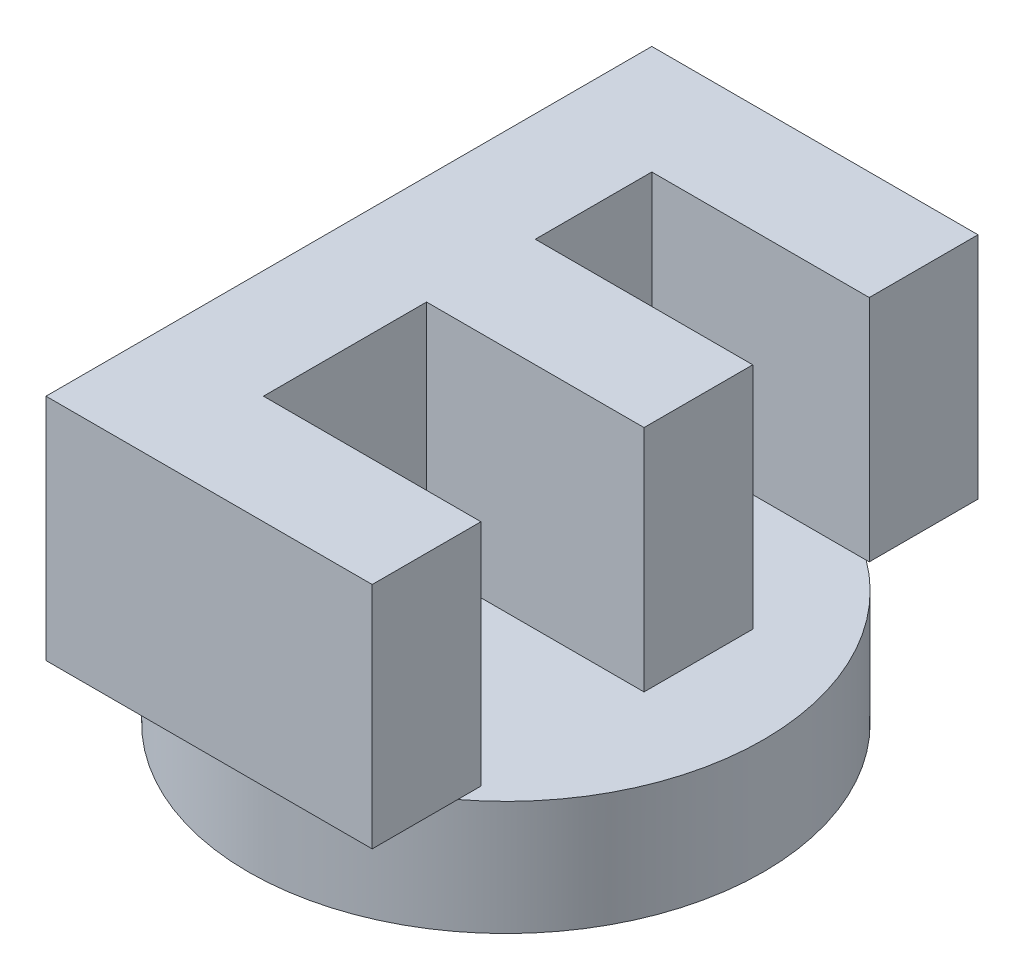
ISO-10303-21;
HEADER;
FILE_DESCRIPTION(('STEP AP214'),'2;1');
FILE_NAME('part.step','',(''),(''),'','','');
FILE_SCHEMA(('AUTOMOTIVE_DESIGN { 1 0 10303 214 1 1 1 1 }'));
ENDSEC;
DATA;
#1=APPLICATION_CONTEXT('core data for automotive mechanical design processes');
#2=APPLICATION_PROTOCOL_DEFINITION('international standard','automotive_design',2000,#1);
#3=PRODUCT_CONTEXT('',#1,'mechanical');
#4=PRODUCT('Part','Part','',(#3));
#5=PRODUCT_RELATED_PRODUCT_CATEGORY('part','',(#4));
#6=PRODUCT_DEFINITION_FORMATION('','',#4);
#7=PRODUCT_DEFINITION_CONTEXT('part definition',#1,'design');
#8=PRODUCT_DEFINITION('design','',#6,#7);
#9=PRODUCT_DEFINITION_SHAPE('','',#8);
#10=(LENGTH_UNIT() NAMED_UNIT(*) SI_UNIT(.MILLI.,.METRE.));
#11=(NAMED_UNIT(*) PLANE_ANGLE_UNIT() SI_UNIT($,.RADIAN.));
#12=(NAMED_UNIT(*) SI_UNIT($,.STERADIAN.) SOLID_ANGLE_UNIT());
#13=UNCERTAINTY_MEASURE_WITH_UNIT(LENGTH_MEASURE(1.E-05),#10,'distance_accuracy_value','');
#14=(GEOMETRIC_REPRESENTATION_CONTEXT(3) GLOBAL_UNCERTAINTY_ASSIGNED_CONTEXT((#13)) GLOBAL_UNIT_ASSIGNED_CONTEXT((#10,
#11,#12)) REPRESENTATION_CONTEXT('',''));
#15=CARTESIAN_POINT('',(0.,0.,0.));
#16=DIRECTION('',(0.,0.,1.));
#17=DIRECTION('',(1.,0.,0.));
#18=AXIS2_PLACEMENT_3D('',#15,#16,#17);
#19=CARTESIAN_POINT('',(0.,10.,0.));
#20=DIRECTION('',(0.,1.,0.));
#21=DIRECTION('',(0.,0.,1.));
#22=AXIS2_PLACEMENT_3D('',#19,#20,#21);
#23=PLANE('',#22);
#24=CARTESIAN_POINT('',(0.,10.,0.));
#25=DIRECTION('',(0.,1.,0.));
#26=DIRECTION('',(0.,0.,1.));
#27=AXIS2_PLACEMENT_3D('',#24,#25,#26);
#28=CIRCLE('',#27,22.5);
#29=CARTESIAN_POINT('',(-14.8289017434471,10.,-16.9219878584991));
#30=VERTEX_POINT('',#29);
#31=CARTESIAN_POINT('',(-14.8289017434471,10.,16.9219878584991));
#32=VERTEX_POINT('',#31);
#33=EDGE_CURVE('E310',#30,#32,#28,.T.);
#34=ORIENTED_EDGE('',*,*,#33,.T.);
#35=DIRECTION('',(0.,0.,-1.));
#36=VECTOR('',#35,1.);
#37=CARTESIAN_POINT('',(-14.8289017434471,10.,25.3420770777684));
#38=LINE('',#37,#36);
#39=EDGE_CURVE('E11',#32,#30,#38,.T.);
#40=ORIENTED_EDGE('',*,*,#39,.T.);
#41=EDGE_LOOP('',(#34,#40));
#42=FACE_BOUND('',#41,.T.);
#43=ADVANCED_FACE('F41',(#42),#23,.T.);
#44=CARTESIAN_POINT('',(13.6646880001427,10.,17.8752986508969));
#45=VERTEX_POINT('',#44);
#46=CARTESIAN_POINT('',(13.3970879220572,10.,-18.076726341035));
#47=VERTEX_POINT('',#46);
#48=EDGE_CURVE('E303',#45,#47,#28,.T.);
#49=ORIENTED_EDGE('',*,*,#48,.T.);
#50=DIRECTION('',(-1.,0.,0.));
#51=VECTOR('',#50,1.);
#52=CARTESIAN_POINT('',(13.6646880001427,10.,-18.076726341035));
#53=LINE('',#52,#51);
#54=CARTESIAN_POINT('',(-5.33103849558383,10.,-18.076726341035));
#55=VERTEX_POINT('',#54);
#56=EDGE_CURVE('E50',#47,#55,#53,.T.);
#57=ORIENTED_EDGE('',*,*,#56,.T.);
#58=DIRECTION('',(0.,0.,1.));
#59=VECTOR('',#58,1.);
#60=CARTESIAN_POINT('',(-5.33103849558383,10.,-18.076726341035));
#61=LINE('',#60,#59);
#62=CARTESIAN_POINT('',(-5.33103849558383,10.,-7.90044428975293));
#63=VERTEX_POINT('',#62);
#64=EDGE_CURVE('E257',#55,#63,#61,.T.);
#65=ORIENTED_EDGE('',*,*,#64,.T.);
#66=DIRECTION('',(1.,0.,0.));
#67=VECTOR('',#66,1.);
#68=CARTESIAN_POINT('',(-5.33103849558383,10.,-7.90044428975293));
#69=LINE('',#68,#67);
#70=CARTESIAN_POINT('',(13.6646880001427,10.,-7.90044428975293));
#71=VERTEX_POINT('',#70);
#72=EDGE_CURVE('E260',#63,#71,#69,.T.);
#73=ORIENTED_EDGE('',*,*,#72,.T.);
#74=DIRECTION('',(0.,0.,1.));
#75=VECTOR('',#74,1.);
#76=CARTESIAN_POINT('',(13.6646880001427,10.,-7.90044428975293));
#77=LINE('',#76,#75);
#78=CARTESIAN_POINT('',(13.6646880001427,10.,1.59741895811032));
#79=VERTEX_POINT('',#78);
#80=EDGE_CURVE('E263',#71,#79,#77,.T.);
#81=ORIENTED_EDGE('',*,*,#80,.T.);
#82=DIRECTION('',(-1.,0.,0.));
#83=VECTOR('',#82,1.);
#84=CARTESIAN_POINT('',(13.6646880001427,10.,1.59741895811032));
#85=LINE('',#84,#83);
#86=CARTESIAN_POINT('',(-5.33103849558383,10.,1.59741895811032));
#87=VERTEX_POINT('',#86);
#88=EDGE_CURVE('E266',#79,#87,#85,.T.);
#89=ORIENTED_EDGE('',*,*,#88,.T.);
#90=DIRECTION('',(0.,0.,1.));
#91=VECTOR('',#90,1.);
#92=CARTESIAN_POINT('',(-5.33103849558383,10.,1.59741895811032));
#93=LINE('',#92,#91);
#94=CARTESIAN_POINT('',(-5.33103849558383,10.,15.8442138299052));
#95=VERTEX_POINT('',#94);
#96=EDGE_CURVE('E269',#87,#95,#93,.T.);
#97=ORIENTED_EDGE('',*,*,#96,.T.);
#98=DIRECTION('',(1.,0.,0.));
#99=VECTOR('',#98,1.);
#100=CARTESIAN_POINT('',(-5.33103849558383,10.,15.8442138299052));
#101=LINE('',#100,#99);
#102=CARTESIAN_POINT('',(13.6646880001427,10.,15.8442138299052));
#103=VERTEX_POINT('',#102);
#104=EDGE_CURVE('E272',#95,#103,#101,.T.);
#105=ORIENTED_EDGE('',*,*,#104,.T.);
#106=DIRECTION('',(0.,0.,1.));
#107=VECTOR('',#106,1.);
#108=CARTESIAN_POINT('',(13.6646880001427,10.,15.8442138299052));
#109=LINE('',#108,#107);
#110=EDGE_CURVE('E275',#103,#45,#109,.T.);
#111=ORIENTED_EDGE('',*,*,#110,.T.);
#112=EDGE_LOOP('',(#49,#57,#65,#73,#81,#89,#97,#105,#111));
#113=FACE_BOUND('',#112,.T.);
#114=ADVANCED_FACE('F332',(#113),#23,.T.);
#115=CARTESIAN_POINT('',(0.,10.,0.));
#116=DIRECTION('',(0.,-1.,0.));
#117=DIRECTION('',(0.,0.,-1.));
#118=AXIS2_PLACEMENT_3D('',#115,#116,#117);
#119=CYLINDRICAL_SURFACE('',#118,22.5);
#120=ORIENTED_EDGE('',*,*,#48,.F.);
#121=EDGE_CURVE('E306',#32,#45,#28,.T.);
#122=ORIENTED_EDGE('',*,*,#121,.F.);
#123=ORIENTED_EDGE('',*,*,#33,.F.);
#124=EDGE_CURVE('E305',#47,#30,#28,.T.);
#125=ORIENTED_EDGE('',*,*,#124,.F.);
#126=EDGE_LOOP('',(#120,#122,#123,#125));
#127=FACE_BOUND('',#126,.T.);
#128=CARTESIAN_POINT('',(0.,0.,0.));
#129=DIRECTION('',(0.,1.,0.));
#130=DIRECTION('',(0.,0.,1.));
#131=AXIS2_PLACEMENT_3D('',#128,#129,#130);
#132=CIRCLE('',#131,22.5);
#133=CARTESIAN_POINT('',(0.,0.,22.5));
#134=VERTEX_POINT('',#133);
#135=EDGE_CURVE('E45',#134,#134,#132,.T.);
#136=ORIENTED_EDGE('',*,*,#135,.T.);
#137=EDGE_LOOP('',(#136));
#138=FACE_BOUND('',#137,.T.);
#139=ADVANCED_FACE('F43',(#127,#138),#119,.T.);
#140=CARTESIAN_POINT('',(0.,0.,0.));
#141=DIRECTION('',(0.,1.,0.));
#142=DIRECTION('',(0.,0.,1.));
#143=AXIS2_PLACEMENT_3D('',#140,#141,#142);
#144=PLANE('',#143);
#145=CARTESIAN_POINT('',(0.,0.,0.));
#146=DIRECTION('',(0.,-1.,0.));
#147=DIRECTION('',(0.,0.,-1.));
#148=AXIS2_PLACEMENT_3D('',#145,#146,#147);
#149=CIRCLE('',#148,21.5);
#150=CARTESIAN_POINT('',(4.83856503950974,0.,20.9484674465326));
#151=VERTEX_POINT('',#150);
#152=CARTESIAN_POINT('',(-4.83856503950294,0.,20.9484674465341));
#153=VERTEX_POINT('',#152);
#154=EDGE_CURVE('E200',#151,#153,#149,.T.);
#155=ORIENTED_EDGE('',*,*,#154,.F.);
#156=DIRECTION('',(-0.471428571428459,0.,0.881904247660097));
#157=VECTOR('',#156,1.);
#158=CARTESIAN_POINT('',(12.4726457883362,0.,6.66734693877418));
#159=LINE('',#158,#157);
#160=CARTESIAN_POINT('',(14.5514200863916,0.,2.77857142856957));
#161=VERTEX_POINT('',#160);
#162=EDGE_CURVE('E60',#161,#151,#159,.T.);
#163=ORIENTED_EDGE('',*,*,#162,.F.);
#164=CARTESIAN_POINT('',(0.,0.,-5.));
#165=DIRECTION('',(0.,-1.,0.));
#166=DIRECTION('',(0.,0.,-1.));
#167=AXIS2_PLACEMENT_3D('',#164,#165,#166);
#168=CIRCLE('',#167,16.5);
#169=CARTESIAN_POINT('',(-14.5514200863896,0.,2.77857142857328));
#170=VERTEX_POINT('',#169);
#171=EDGE_CURVE('E191',#170,#161,#168,.T.);
#172=ORIENTED_EDGE('',*,*,#171,.F.);
#173=DIRECTION('',(-0.471428571428684,0.,-0.881904247659977));
#174=VECTOR('',#173,1.);
#175=CARTESIAN_POINT('',(-12.4726457883335,0.,6.66734693877684));
#176=LINE('',#175,#174);
#177=EDGE_CURVE('E194',#153,#170,#176,.T.);
#178=ORIENTED_EDGE('',*,*,#177,.F.);
#179=EDGE_LOOP('',(#155,#163,#172,#178));
#180=FACE_BOUND('',#179,.T.);
#181=ORIENTED_EDGE('',*,*,#135,.F.);
#182=EDGE_LOOP('',(#181));
#183=FACE_BOUND('',#182,.T.);
#184=ADVANCED_FACE('F318',(#180,#183),#144,.F.);
#185=CARTESIAN_POINT('',(0.,10.,0.));
#186=DIRECTION('',(0.,-1.,0.));
#187=DIRECTION('',(0.,0.,-1.));
#188=AXIS2_PLACEMENT_3D('',#185,#186,#187);
#189=PLANE('',#188);
#190=CARTESIAN_POINT('',(13.6646880001427,10.,-18.076726341035));
#191=VERTEX_POINT('',#190);
#192=EDGE_CURVE('E254',#191,#47,#53,.T.);
#193=ORIENTED_EDGE('',*,*,#192,.T.);
#194=ORIENTED_EDGE('',*,*,#124,.T.);
#195=CARTESIAN_POINT('',(-14.8289017434471,10.,-27.5745895888982));
#196=VERTEX_POINT('',#195);
#197=EDGE_CURVE('E53',#30,#196,#38,.T.);
#198=ORIENTED_EDGE('',*,*,#197,.T.);
#199=DIRECTION('',(1.,0.,0.));
#200=VECTOR('',#199,1.);
#201=CARTESIAN_POINT('',(-14.8289017434471,10.,-27.5745895888982));
#202=LINE('',#201,#200);
#203=CARTESIAN_POINT('',(13.6646880001427,10.,-27.5745895888982));
#204=VERTEX_POINT('',#203);
#205=EDGE_CURVE('E248',#196,#204,#202,.T.);
#206=ORIENTED_EDGE('',*,*,#205,.T.);
#207=DIRECTION('',(0.,0.,1.));
#208=VECTOR('',#207,1.);
#209=CARTESIAN_POINT('',(13.6646880001427,10.,-27.5745895888982));
#210=LINE('',#209,#208);
#211=EDGE_CURVE('E251',#204,#191,#210,.T.);
#212=ORIENTED_EDGE('',*,*,#211,.T.);
#213=EDGE_LOOP('',(#193,#194,#198,#206,#212));
#214=FACE_BOUND('',#213,.T.);
#215=ADVANCED_FACE('F320',(#214),#189,.T.);
#216=CARTESIAN_POINT('',(-14.8289017434471,30.,25.3420770777684));
#217=DIRECTION('',(-1.,0.,0.));
#218=DIRECTION('',(0.,0.,1.));
#219=AXIS2_PLACEMENT_3D('',#216,#217,#218);
#220=PLANE('',#219);
#221=CARTESIAN_POINT('',(-14.8289017434471,10.,25.3420770777684));
#222=VERTEX_POINT('',#221);
#223=EDGE_CURVE('E52',#222,#32,#38,.T.);
#224=ORIENTED_EDGE('',*,*,#223,.F.);
#225=DIRECTION('',(0.,-1.,0.));
#226=VECTOR('',#225,1.);
#227=CARTESIAN_POINT('',(-14.8289017434471,30.,25.3420770777684));
#228=LINE('',#227,#226);
#229=CARTESIAN_POINT('',(-14.8289017434471,30.,25.3420770777684));
#230=VERTEX_POINT('',#229);
#231=EDGE_CURVE('E280',#230,#222,#228,.T.);
#232=ORIENTED_EDGE('',*,*,#231,.F.);
#233=DIRECTION('',(0.,0.,-1.));
#234=VECTOR('',#233,1.);
#235=CARTESIAN_POINT('',(-14.8289017434471,30.,25.3420770777684));
#236=LINE('',#235,#234);
#237=CARTESIAN_POINT('',(-14.8289017434471,30.,-27.5745895888982));
#238=VERTEX_POINT('',#237);
#239=EDGE_CURVE('E209',#230,#238,#236,.T.);
#240=ORIENTED_EDGE('',*,*,#239,.T.);
#241=DIRECTION('',(0.,-1.,0.));
#242=VECTOR('',#241,1.);
#243=CARTESIAN_POINT('',(-14.8289017434471,30.,-27.5745895888982));
#244=LINE('',#243,#242);
#245=EDGE_CURVE('E245',#238,#196,#244,.T.);
#246=ORIENTED_EDGE('',*,*,#245,.T.);
#247=ORIENTED_EDGE('',*,*,#197,.F.);
#248=ORIENTED_EDGE('',*,*,#39,.F.);
#249=EDGE_LOOP('',(#224,#232,#240,#246,#247,#248));
#250=FACE_BOUND('',#249,.T.);
#251=ADVANCED_FACE('F327',(#250),#220,.T.);
#252=CARTESIAN_POINT('',(13.6646880001427,30.,25.3420770777684));
#253=DIRECTION('',(0.,0.,1.));
#254=DIRECTION('',(1.,0.,0.));
#255=AXIS2_PLACEMENT_3D('',#252,#253,#254);
#256=PLANE('',#255);
#257=DIRECTION('',(-1.,0.,0.));
#258=VECTOR('',#257,1.);
#259=CARTESIAN_POINT('',(13.6646880001427,10.,25.3420770777684));
#260=LINE('',#259,#258);
#261=CARTESIAN_POINT('',(13.6646880001427,10.,25.3420770777684));
#262=VERTEX_POINT('',#261);
#263=EDGE_CURVE('E213',#262,#222,#260,.T.);
#264=ORIENTED_EDGE('',*,*,#263,.F.);
#265=DIRECTION('',(0.,-1.,0.));
#266=VECTOR('',#265,1.);
#267=CARTESIAN_POINT('',(13.6646880001427,30.,25.3420770777684));
#268=LINE('',#267,#266);
#269=CARTESIAN_POINT('',(13.6646880001427,30.,25.3420770777684));
#270=VERTEX_POINT('',#269);
#271=EDGE_CURVE('E282',#270,#262,#268,.T.);
#272=ORIENTED_EDGE('',*,*,#271,.F.);
#273=DIRECTION('',(-1.,0.,0.));
#274=VECTOR('',#273,1.);
#275=CARTESIAN_POINT('',(13.6646880001427,30.,25.3420770777684));
#276=LINE('',#275,#274);
#277=EDGE_CURVE('E243',#270,#230,#276,.T.);
#278=ORIENTED_EDGE('',*,*,#277,.T.);
#279=ORIENTED_EDGE('',*,*,#231,.T.);
#280=EDGE_LOOP('',(#264,#272,#278,#279));
#281=FACE_BOUND('',#280,.T.);
#282=ADVANCED_FACE('F343',(#281),#256,.T.);
#283=CARTESIAN_POINT('',(13.6646880001427,30.,15.8442138299052));
#284=DIRECTION('',(1.,0.,0.));
#285=DIRECTION('',(0.,0.,-1.));
#286=AXIS2_PLACEMENT_3D('',#283,#284,#285);
#287=PLANE('',#286);
#288=ORIENTED_EDGE('',*,*,#110,.F.);
#289=DIRECTION('',(0.,-1.,0.));
#290=VECTOR('',#289,1.);
#291=CARTESIAN_POINT('',(13.6646880001427,30.,15.8442138299052));
#292=LINE('',#291,#290);
#293=CARTESIAN_POINT('',(13.6646880001427,30.,15.8442138299052));
#294=VERTEX_POINT('',#293);
#295=EDGE_CURVE('E284',#294,#103,#292,.T.);
#296=ORIENTED_EDGE('',*,*,#295,.F.);
#297=DIRECTION('',(0.,0.,1.));
#298=VECTOR('',#297,1.);
#299=CARTESIAN_POINT('',(13.6646880001427,30.,15.8442138299052));
#300=LINE('',#299,#298);
#301=EDGE_CURVE('E240',#294,#270,#300,.T.);
#302=ORIENTED_EDGE('',*,*,#301,.T.);
#303=ORIENTED_EDGE('',*,*,#271,.T.);
#304=EDGE_CURVE('E68',#45,#262,#109,.T.);
#305=ORIENTED_EDGE('',*,*,#304,.F.);
#306=EDGE_LOOP('',(#288,#296,#302,#303,#305));
#307=FACE_BOUND('',#306,.T.);
#308=ADVANCED_FACE('F381',(#307),#287,.T.);
#309=CARTESIAN_POINT('',(-5.33103849558383,30.,15.8442138299052));
#310=DIRECTION('',(0.,0.,-1.));
#311=DIRECTION('',(-1.,0.,0.));
#312=AXIS2_PLACEMENT_3D('',#309,#310,#311);
#313=PLANE('',#312);
#314=ORIENTED_EDGE('',*,*,#104,.F.);
#315=DIRECTION('',(0.,-1.,0.));
#316=VECTOR('',#315,1.);
#317=CARTESIAN_POINT('',(-5.33103849558383,30.,15.8442138299052));
#318=LINE('',#317,#316);
#319=CARTESIAN_POINT('',(-5.33103849558383,30.,15.8442138299052));
#320=VERTEX_POINT('',#319);
#321=EDGE_CURVE('E286',#320,#95,#318,.T.);
#322=ORIENTED_EDGE('',*,*,#321,.F.);
#323=DIRECTION('',(1.,0.,0.));
#324=VECTOR('',#323,1.);
#325=CARTESIAN_POINT('',(-5.33103849558383,30.,15.8442138299052));
#326=LINE('',#325,#324);
#327=EDGE_CURVE('E237',#320,#294,#326,.T.);
#328=ORIENTED_EDGE('',*,*,#327,.T.);
#329=ORIENTED_EDGE('',*,*,#295,.T.);
#330=EDGE_LOOP('',(#314,#322,#328,#329));
#331=FACE_BOUND('',#330,.T.);
#332=ADVANCED_FACE('F377',(#331),#313,.T.);
#333=CARTESIAN_POINT('',(-5.33103849558383,30.,1.59741895811032));
#334=DIRECTION('',(1.,0.,0.));
#335=DIRECTION('',(0.,0.,-1.));
#336=AXIS2_PLACEMENT_3D('',#333,#334,#335);
#337=PLANE('',#336);
#338=ORIENTED_EDGE('',*,*,#96,.F.);
#339=DIRECTION('',(0.,-1.,0.));
#340=VECTOR('',#339,1.);
#341=CARTESIAN_POINT('',(-5.33103849558383,30.,1.59741895811032));
#342=LINE('',#341,#340);
#343=CARTESIAN_POINT('',(-5.33103849558383,30.,1.59741895811032));
#344=VERTEX_POINT('',#343);
#345=EDGE_CURVE('E288',#344,#87,#342,.T.);
#346=ORIENTED_EDGE('',*,*,#345,.F.);
#347=DIRECTION('',(0.,0.,1.));
#348=VECTOR('',#347,1.);
#349=CARTESIAN_POINT('',(-5.33103849558383,30.,1.59741895811032));
#350=LINE('',#349,#348);
#351=EDGE_CURVE('E234',#344,#320,#350,.T.);
#352=ORIENTED_EDGE('',*,*,#351,.T.);
#353=ORIENTED_EDGE('',*,*,#321,.T.);
#354=EDGE_LOOP('',(#338,#346,#352,#353));
#355=FACE_BOUND('',#354,.T.);
#356=ADVANCED_FACE('F373',(#355),#337,.T.);
#357=CARTESIAN_POINT('',(13.6646880001427,30.,1.59741895811032));
#358=DIRECTION('',(0.,0.,1.));
#359=DIRECTION('',(1.,0.,0.));
#360=AXIS2_PLACEMENT_3D('',#357,#358,#359);
#361=PLANE('',#360);
#362=ORIENTED_EDGE('',*,*,#88,.F.);
#363=DIRECTION('',(0.,-1.,0.));
#364=VECTOR('',#363,1.);
#365=CARTESIAN_POINT('',(13.6646880001427,30.,1.59741895811032));
#366=LINE('',#365,#364);
#367=CARTESIAN_POINT('',(13.6646880001427,30.,1.59741895811032));
#368=VERTEX_POINT('',#367);
#369=EDGE_CURVE('E290',#368,#79,#366,.T.);
#370=ORIENTED_EDGE('',*,*,#369,.F.);
#371=DIRECTION('',(-1.,0.,0.));
#372=VECTOR('',#371,1.);
#373=CARTESIAN_POINT('',(13.6646880001427,30.,1.59741895811032));
#374=LINE('',#373,#372);
#375=EDGE_CURVE('E231',#368,#344,#374,.T.);
#376=ORIENTED_EDGE('',*,*,#375,.T.);
#377=ORIENTED_EDGE('',*,*,#345,.T.);
#378=EDGE_LOOP('',(#362,#370,#376,#377));
#379=FACE_BOUND('',#378,.T.);
#380=ADVANCED_FACE('F369',(#379),#361,.T.);
#381=CARTESIAN_POINT('',(13.6646880001427,30.,-7.90044428975293));
#382=DIRECTION('',(1.,0.,0.));
#383=DIRECTION('',(0.,0.,-1.));
#384=AXIS2_PLACEMENT_3D('',#381,#382,#383);
#385=PLANE('',#384);
#386=ORIENTED_EDGE('',*,*,#80,.F.);
#387=DIRECTION('',(0.,-1.,0.));
#388=VECTOR('',#387,1.);
#389=CARTESIAN_POINT('',(13.6646880001427,30.,-7.90044428975293));
#390=LINE('',#389,#388);
#391=CARTESIAN_POINT('',(13.6646880001427,30.,-7.90044428975293));
#392=VERTEX_POINT('',#391);
#393=EDGE_CURVE('E292',#392,#71,#390,.T.);
#394=ORIENTED_EDGE('',*,*,#393,.F.);
#395=DIRECTION('',(0.,0.,1.));
#396=VECTOR('',#395,1.);
#397=CARTESIAN_POINT('',(13.6646880001427,30.,-7.90044428975293));
#398=LINE('',#397,#396);
#399=EDGE_CURVE('E228',#392,#368,#398,.T.);
#400=ORIENTED_EDGE('',*,*,#399,.T.);
#401=ORIENTED_EDGE('',*,*,#369,.T.);
#402=EDGE_LOOP('',(#386,#394,#400,#401));
#403=FACE_BOUND('',#402,.T.);
#404=ADVANCED_FACE('F365',(#403),#385,.T.);
#405=CARTESIAN_POINT('',(-5.33103849558383,30.,-7.90044428975293));
#406=DIRECTION('',(0.,0.,-1.));
#407=DIRECTION('',(-1.,0.,0.));
#408=AXIS2_PLACEMENT_3D('',#405,#406,#407);
#409=PLANE('',#408);
#410=ORIENTED_EDGE('',*,*,#72,.F.);
#411=DIRECTION('',(0.,-1.,0.));
#412=VECTOR('',#411,1.);
#413=CARTESIAN_POINT('',(-5.33103849558383,30.,-7.90044428975293));
#414=LINE('',#413,#412);
#415=CARTESIAN_POINT('',(-5.33103849558383,30.,-7.90044428975293));
#416=VERTEX_POINT('',#415);
#417=EDGE_CURVE('E294',#416,#63,#414,.T.);
#418=ORIENTED_EDGE('',*,*,#417,.F.);
#419=DIRECTION('',(1.,0.,0.));
#420=VECTOR('',#419,1.);
#421=CARTESIAN_POINT('',(-5.33103849558383,30.,-7.90044428975293));
#422=LINE('',#421,#420);
#423=EDGE_CURVE('E225',#416,#392,#422,.T.);
#424=ORIENTED_EDGE('',*,*,#423,.T.);
#425=ORIENTED_EDGE('',*,*,#393,.T.);
#426=EDGE_LOOP('',(#410,#418,#424,#425));
#427=FACE_BOUND('',#426,.T.);
#428=ADVANCED_FACE('F361',(#427),#409,.T.);
#429=CARTESIAN_POINT('',(-5.33103849558383,30.,-18.076726341035));
#430=DIRECTION('',(1.,0.,0.));
#431=DIRECTION('',(0.,0.,-1.));
#432=AXIS2_PLACEMENT_3D('',#429,#430,#431);
#433=PLANE('',#432);
#434=ORIENTED_EDGE('',*,*,#64,.F.);
#435=DIRECTION('',(0.,-1.,0.));
#436=VECTOR('',#435,1.);
#437=CARTESIAN_POINT('',(-5.33103849558383,30.,-18.076726341035));
#438=LINE('',#437,#436);
#439=CARTESIAN_POINT('',(-5.33103849558383,30.,-18.076726341035));
#440=VERTEX_POINT('',#439);
#441=EDGE_CURVE('E296',#440,#55,#438,.T.);
#442=ORIENTED_EDGE('',*,*,#441,.F.);
#443=DIRECTION('',(0.,0.,1.));
#444=VECTOR('',#443,1.);
#445=CARTESIAN_POINT('',(-5.33103849558383,30.,-18.076726341035));
#446=LINE('',#445,#444);
#447=EDGE_CURVE('E222',#440,#416,#446,.T.);
#448=ORIENTED_EDGE('',*,*,#447,.T.);
#449=ORIENTED_EDGE('',*,*,#417,.T.);
#450=EDGE_LOOP('',(#434,#442,#448,#449));
#451=FACE_BOUND('',#450,.T.);
#452=ADVANCED_FACE('F357',(#451),#433,.T.);
#453=CARTESIAN_POINT('',(13.6646880001427,30.,-18.076726341035));
#454=DIRECTION('',(0.,0.,1.));
#455=DIRECTION('',(1.,0.,0.));
#456=AXIS2_PLACEMENT_3D('',#453,#454,#455);
#457=PLANE('',#456);
#458=ORIENTED_EDGE('',*,*,#192,.F.);
#459=DIRECTION('',(0.,-1.,0.));
#460=VECTOR('',#459,1.);
#461=CARTESIAN_POINT('',(13.6646880001427,30.,-18.076726341035));
#462=LINE('',#461,#460);
#463=CARTESIAN_POINT('',(13.6646880001427,30.,-18.076726341035));
#464=VERTEX_POINT('',#463);
#465=EDGE_CURVE('E298',#464,#191,#462,.T.);
#466=ORIENTED_EDGE('',*,*,#465,.F.);
#467=DIRECTION('',(-1.,0.,0.));
#468=VECTOR('',#467,1.);
#469=CARTESIAN_POINT('',(13.6646880001427,30.,-18.076726341035));
#470=LINE('',#469,#468);
#471=EDGE_CURVE('E219',#464,#440,#470,.T.);
#472=ORIENTED_EDGE('',*,*,#471,.T.);
#473=ORIENTED_EDGE('',*,*,#441,.T.);
#474=ORIENTED_EDGE('',*,*,#56,.F.);
#475=EDGE_LOOP('',(#458,#466,#472,#473,#474));
#476=FACE_BOUND('',#475,.T.);
#477=ADVANCED_FACE('F353',(#476),#457,.T.);
#478=CARTESIAN_POINT('',(13.6646880001427,30.,-27.5745895888982));
#479=DIRECTION('',(1.,0.,0.));
#480=DIRECTION('',(0.,0.,-1.));
#481=AXIS2_PLACEMENT_3D('',#478,#479,#480);
#482=PLANE('',#481);
#483=ORIENTED_EDGE('',*,*,#211,.F.);
#484=DIRECTION('',(0.,-1.,0.));
#485=VECTOR('',#484,1.);
#486=CARTESIAN_POINT('',(13.6646880001427,30.,-27.5745895888982));
#487=LINE('',#486,#485);
#488=CARTESIAN_POINT('',(13.6646880001427,30.,-27.5745895888982));
#489=VERTEX_POINT('',#488);
#490=EDGE_CURVE('E300',#489,#204,#487,.T.);
#491=ORIENTED_EDGE('',*,*,#490,.F.);
#492=DIRECTION('',(0.,0.,1.));
#493=VECTOR('',#492,1.);
#494=CARTESIAN_POINT('',(13.6646880001427,30.,-27.5745895888982));
#495=LINE('',#494,#493);
#496=EDGE_CURVE('E216',#489,#464,#495,.T.);
#497=ORIENTED_EDGE('',*,*,#496,.T.);
#498=ORIENTED_EDGE('',*,*,#465,.T.);
#499=EDGE_LOOP('',(#483,#491,#497,#498));
#500=FACE_BOUND('',#499,.T.);
#501=ADVANCED_FACE('F349',(#500),#482,.T.);
#502=CARTESIAN_POINT('',(-14.8289017434471,30.,-27.5745895888982));
#503=DIRECTION('',(0.,0.,-1.));
#504=DIRECTION('',(-1.,0.,0.));
#505=AXIS2_PLACEMENT_3D('',#502,#503,#504);
#506=PLANE('',#505);
#507=ORIENTED_EDGE('',*,*,#205,.F.);
#508=ORIENTED_EDGE('',*,*,#245,.F.);
#509=DIRECTION('',(1.,0.,0.));
#510=VECTOR('',#509,1.);
#511=CARTESIAN_POINT('',(-14.8289017434471,30.,-27.5745895888982));
#512=LINE('',#511,#510);
#513=EDGE_CURVE('E212',#238,#489,#512,.T.);
#514=ORIENTED_EDGE('',*,*,#513,.T.);
#515=ORIENTED_EDGE('',*,*,#490,.T.);
#516=EDGE_LOOP('',(#507,#508,#514,#515));
#517=FACE_BOUND('',#516,.T.);
#518=ADVANCED_FACE('F345',(#517),#506,.T.);
#519=CARTESIAN_POINT('',(0.,30.,0.));
#520=DIRECTION('',(0.,-1.,0.));
#521=DIRECTION('',(0.,0.,-1.));
#522=AXIS2_PLACEMENT_3D('',#519,#520,#521);
#523=PLANE('',#522);
#524=ORIENTED_EDGE('',*,*,#239,.F.);
#525=ORIENTED_EDGE('',*,*,#277,.F.);
#526=ORIENTED_EDGE('',*,*,#301,.F.);
#527=ORIENTED_EDGE('',*,*,#327,.F.);
#528=ORIENTED_EDGE('',*,*,#351,.F.);
#529=ORIENTED_EDGE('',*,*,#375,.F.);
#530=ORIENTED_EDGE('',*,*,#399,.F.);
#531=ORIENTED_EDGE('',*,*,#423,.F.);
#532=ORIENTED_EDGE('',*,*,#447,.F.);
#533=ORIENTED_EDGE('',*,*,#471,.F.);
#534=ORIENTED_EDGE('',*,*,#496,.F.);
#535=ORIENTED_EDGE('',*,*,#513,.F.);
#536=EDGE_LOOP('',(#524,#525,#526,#527,#528,#529,#530,#531,#532,#533,#534,#535));
#537=FACE_BOUND('',#536,.T.);
#538=ADVANCED_FACE('F348',(#537),#523,.F.);
#539=ORIENTED_EDGE('',*,*,#223,.T.);
#540=ORIENTED_EDGE('',*,*,#121,.T.);
#541=ORIENTED_EDGE('',*,*,#304,.T.);
#542=ORIENTED_EDGE('',*,*,#263,.T.);
#543=EDGE_LOOP('',(#539,#540,#541,#542));
#544=FACE_BOUND('',#543,.T.);
#545=ADVANCED_FACE('F330',(#544),#189,.T.);
#546=CARTESIAN_POINT('',(12.4726457883362,5.,6.66734693877418));
#547=DIRECTION('',(0.881904247660097,0.,0.471428571428459));
#548=DIRECTION('',(0.471428571428459,0.,-0.881904247660097));
#549=AXIS2_PLACEMENT_3D('',#546,#547,#548);
#550=PLANE('',#549);
#551=ORIENTED_EDGE('',*,*,#162,.T.);
#552=DIRECTION('',(0.,-1.,0.));
#553=VECTOR('',#552,1.);
#554=CARTESIAN_POINT('',(4.83856503950974,5.,20.9484674465326));
#555=LINE('',#554,#553);
#556=CARTESIAN_POINT('',(4.83856503950974,5.,20.9484674465326));
#557=VERTEX_POINT('',#556);
#558=EDGE_CURVE('E169',#557,#151,#555,.T.);
#559=ORIENTED_EDGE('',*,*,#558,.F.);
#560=DIRECTION('',(-0.471428571428459,0.,0.881904247660097));
#561=VECTOR('',#560,1.);
#562=CARTESIAN_POINT('',(12.4726457883362,5.,6.66734693877418));
#563=LINE('',#562,#561);
#564=CARTESIAN_POINT('',(14.5514200863916,5.,2.77857142856957));
#565=VERTEX_POINT('',#564);
#566=EDGE_CURVE('E173',#565,#557,#563,.T.);
#567=ORIENTED_EDGE('',*,*,#566,.F.);
#568=DIRECTION('',(0.,-1.,0.));
#569=VECTOR('',#568,1.);
#570=CARTESIAN_POINT('',(14.5514200863916,5.,2.77857142856957));
#571=LINE('',#570,#569);
#572=EDGE_CURVE('E204',#565,#161,#571,.T.);
#573=ORIENTED_EDGE('',*,*,#572,.T.);
#574=EDGE_LOOP('',(#551,#559,#567,#573));
#575=FACE_BOUND('',#574,.T.);
#576=ADVANCED_FACE('F171',(#575),#550,.F.);
#577=CARTESIAN_POINT('',(0.,5.,-5.));
#578=DIRECTION('',(0.,-1.,0.));
#579=DIRECTION('',(0.,0.,-1.));
#580=AXIS2_PLACEMENT_3D('',#577,#578,#579);
#581=CYLINDRICAL_SURFACE('',#580,16.5);
#582=ORIENTED_EDGE('',*,*,#171,.T.);
#583=ORIENTED_EDGE('',*,*,#572,.F.);
#584=CARTESIAN_POINT('',(0.,5.,-5.));
#585=DIRECTION('',(0.,-1.,0.));
#586=DIRECTION('',(0.,0.,-1.));
#587=AXIS2_PLACEMENT_3D('',#584,#585,#586);
#588=CIRCLE('',#587,16.5);
#589=CARTESIAN_POINT('',(-14.5514200863896,5.,2.77857142857328));
#590=VERTEX_POINT('',#589);
#591=EDGE_CURVE('E179',#590,#565,#588,.T.);
#592=ORIENTED_EDGE('',*,*,#591,.F.);
#593=DIRECTION('',(0.,-1.,0.));
#594=VECTOR('',#593,1.);
#595=CARTESIAN_POINT('',(-14.5514200863896,5.,2.77857142857328));
#596=LINE('',#595,#594);
#597=EDGE_CURVE('E206',#590,#170,#596,.T.);
#598=ORIENTED_EDGE('',*,*,#597,.T.);
#599=EDGE_LOOP('',(#582,#583,#592,#598));
#600=FACE_BOUND('',#599,.T.);
#601=ADVANCED_FACE('F392',(#600),#581,.F.);
#602=CARTESIAN_POINT('',(-12.4726457883335,5.,6.66734693877684));
#603=DIRECTION('',(-0.881904247659977,0.,0.471428571428684));
#604=DIRECTION('',(0.471428571428684,0.,0.881904247659977));
#605=AXIS2_PLACEMENT_3D('',#602,#603,#604);
#606=PLANE('',#605);
#607=ORIENTED_EDGE('',*,*,#177,.T.);
#608=ORIENTED_EDGE('',*,*,#597,.F.);
#609=DIRECTION('',(-0.471428571428684,0.,-0.881904247659977));
#610=VECTOR('',#609,1.);
#611=CARTESIAN_POINT('',(-12.4726457883335,5.,6.66734693877684));
#612=LINE('',#611,#610);
#613=CARTESIAN_POINT('',(-4.83856503950294,5.,20.9484674465341));
#614=VERTEX_POINT('',#613);
#615=EDGE_CURVE('E187',#614,#590,#612,.T.);
#616=ORIENTED_EDGE('',*,*,#615,.F.);
#617=DIRECTION('',(0.,-1.,0.));
#618=VECTOR('',#617,1.);
#619=CARTESIAN_POINT('',(-4.83856503950294,5.,20.9484674465341));
#620=LINE('',#619,#618);
#621=EDGE_CURVE('E178',#614,#153,#620,.T.);
#622=ORIENTED_EDGE('',*,*,#621,.T.);
#623=EDGE_LOOP('',(#607,#608,#616,#622));
#624=FACE_BOUND('',#623,.T.);
#625=ADVANCED_FACE('F395',(#624),#606,.F.);
#626=CARTESIAN_POINT('',(0.,5.,0.));
#627=DIRECTION('',(0.,-1.,0.));
#628=DIRECTION('',(0.,0.,-1.));
#629=AXIS2_PLACEMENT_3D('',#626,#627,#628);
#630=CYLINDRICAL_SURFACE('',#629,21.5);
#631=ORIENTED_EDGE('',*,*,#154,.T.);
#632=ORIENTED_EDGE('',*,*,#621,.F.);
#633=CARTESIAN_POINT('',(0.,5.,0.));
#634=DIRECTION('',(0.,-1.,0.));
#635=DIRECTION('',(0.,0.,-1.));
#636=AXIS2_PLACEMENT_3D('',#633,#634,#635);
#637=CIRCLE('',#636,21.5);
#638=EDGE_CURVE('E182',#557,#614,#637,.T.);
#639=ORIENTED_EDGE('',*,*,#638,.F.);
#640=ORIENTED_EDGE('',*,*,#558,.T.);
#641=EDGE_LOOP('',(#631,#632,#639,#640));
#642=FACE_BOUND('',#641,.T.);
#643=ADVANCED_FACE('F183',(#642),#630,.F.);
#644=CARTESIAN_POINT('',(0.,5.,0.));
#645=DIRECTION('',(0.,-1.,0.));
#646=DIRECTION('',(0.,0.,-1.));
#647=AXIS2_PLACEMENT_3D('',#644,#645,#646);
#648=PLANE('',#647);
#649=ORIENTED_EDGE('',*,*,#566,.T.);
#650=ORIENTED_EDGE('',*,*,#638,.T.);
#651=ORIENTED_EDGE('',*,*,#615,.T.);
#652=ORIENTED_EDGE('',*,*,#591,.T.);
#653=EDGE_LOOP('',(#649,#650,#651,#652));
#654=FACE_BOUND('',#653,.T.);
#655=ADVANCED_FACE('F189',(#654),#648,.T.);
#656=CLOSED_SHELL('',(#43,#114,#139,#184,#215,#251,#282,#308,#332,#356,#380,#404,#428,#452,#477,
#501,#518,#538,#545,#576,#601,#625,#643,#655));
#657=MANIFOLD_SOLID_BREP('B2',#656);
#658=ADVANCED_BREP_SHAPE_REPRESENTATION('',(#18,#657),#14);
#659=SHAPE_DEFINITION_REPRESENTATION(#9,#658);
ENDSEC;
END-ISO-10303-21;
